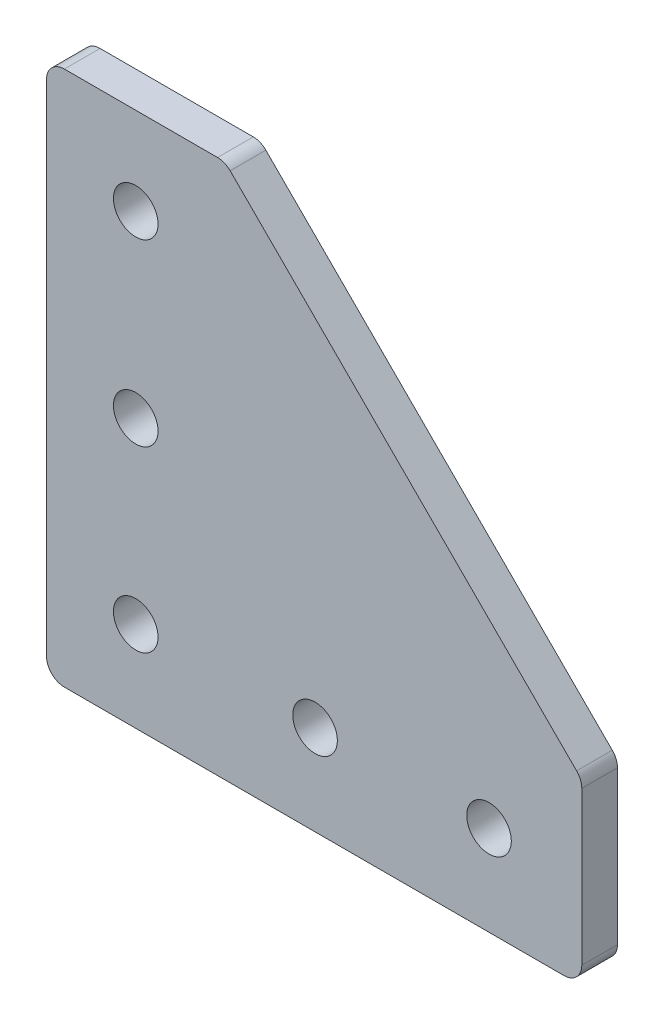
ISO-10303-21;
HEADER;
FILE_DESCRIPTION(('STEP AP214'),'2;1');
FILE_NAME('part.step','',(''),(''),'','','');
FILE_SCHEMA(('AUTOMOTIVE_DESIGN { 1 0 10303 214 1 1 1 1 }'));
ENDSEC;
DATA;
#1=APPLICATION_CONTEXT('core data for automotive mechanical design processes');
#2=APPLICATION_PROTOCOL_DEFINITION('international standard','automotive_design',2000,#1);
#3=PRODUCT_CONTEXT('',#1,'mechanical');
#4=PRODUCT('Part','Part','',(#3));
#5=PRODUCT_RELATED_PRODUCT_CATEGORY('part','',(#4));
#6=PRODUCT_DEFINITION_FORMATION('','',#4);
#7=PRODUCT_DEFINITION_CONTEXT('part definition',#1,'design');
#8=PRODUCT_DEFINITION('design','',#6,#7);
#9=PRODUCT_DEFINITION_SHAPE('','',#8);
#10=(LENGTH_UNIT() NAMED_UNIT(*) SI_UNIT(.MILLI.,.METRE.));
#11=(NAMED_UNIT(*) PLANE_ANGLE_UNIT() SI_UNIT($,.RADIAN.));
#12=(NAMED_UNIT(*) SI_UNIT($,.STERADIAN.) SOLID_ANGLE_UNIT());
#13=UNCERTAINTY_MEASURE_WITH_UNIT(LENGTH_MEASURE(1.E-05),#10,'distance_accuracy_value','');
#14=(GEOMETRIC_REPRESENTATION_CONTEXT(3) GLOBAL_UNCERTAINTY_ASSIGNED_CONTEXT((#13)) GLOBAL_UNIT_ASSIGNED_CONTEXT((#10,
#11,#12)) REPRESENTATION_CONTEXT('',''));
#15=CARTESIAN_POINT('',(0.,0.,0.));
#16=DIRECTION('',(0.,0.,1.));
#17=DIRECTION('',(1.,0.,0.));
#18=AXIS2_PLACEMENT_3D('',#15,#16,#17);
#19=CARTESIAN_POINT('',(-31.3742099073397,-27.0753737227938,0.450058925300255));
#20=DIRECTION('',(0.,1.,0.));
#21=DIRECTION('',(0.,0.,1.));
#22=AXIS2_PLACEMENT_3D('',#19,#20,#21);
#23=PLANE('',#22);
#24=DIRECTION('',(1.,0.,0.));
#25=VECTOR('',#24,1.);
#26=CARTESIAN_POINT('',(-31.3742099073397,-27.0753737227938,-3.54994107469975));
#27=LINE('',#26,#25);
#28=CARTESIAN_POINT('',(-29.3742099073397,-27.0753737227938,-3.54994107469975));
#29=VERTEX_POINT('',#28);
#30=CARTESIAN_POINT('',(26.6257900926603,-27.0753737227938,-3.54994107469975));
#31=VERTEX_POINT('',#30);
#32=EDGE_CURVE('E178',#29,#31,#27,.T.);
#33=ORIENTED_EDGE('',*,*,#32,.T.);
#34=DIRECTION('',(0.,0.,-1.));
#35=VECTOR('',#34,1.);
#36=CARTESIAN_POINT('',(26.6257900926603,-27.0753737227938,0.450058925300255));
#37=LINE('',#36,#35);
#38=CARTESIAN_POINT('',(26.6257900926603,-27.0753737227938,0.450058925300255));
#39=VERTEX_POINT('',#38);
#40=EDGE_CURVE('E149',#31,#39,#37,.F.);
#41=ORIENTED_EDGE('',*,*,#40,.T.);
#42=DIRECTION('',(1.,0.,0.));
#43=VECTOR('',#42,1.);
#44=CARTESIAN_POINT('',(-31.3742099073397,-27.0753737227938,0.450058925300255));
#45=LINE('',#44,#43);
#46=CARTESIAN_POINT('',(-29.3742099073397,-27.0753737227938,0.450058925300255));
#47=VERTEX_POINT('',#46);
#48=EDGE_CURVE('E123',#47,#39,#45,.T.);
#49=ORIENTED_EDGE('',*,*,#48,.F.);
#50=DIRECTION('',(0.,0.,-1.));
#51=VECTOR('',#50,1.);
#52=CARTESIAN_POINT('',(-29.3742099073397,-27.0753737227938,0.450058925300255));
#53=LINE('',#52,#51);
#54=EDGE_CURVE('E146',#47,#29,#53,.T.);
#55=ORIENTED_EDGE('',*,*,#54,.T.);
#56=EDGE_LOOP('',(#33,#41,#49,#55));
#57=FACE_BOUND('',#56,.T.);
#58=ADVANCED_FACE('F16',(#57),#23,.F.);
#59=CARTESIAN_POINT('',(28.6257900926603,-27.0753737227938,0.450058925300255));
#60=DIRECTION('',(-1.,0.,0.));
#61=DIRECTION('',(0.,0.,1.));
#62=AXIS2_PLACEMENT_3D('',#59,#60,#61);
#63=PLANE('',#62);
#64=DIRECTION('',(0.,1.,0.));
#65=VECTOR('',#64,1.);
#66=CARTESIAN_POINT('',(28.6257900926603,-27.0753737227938,-3.54994107469975));
#67=LINE('',#66,#65);
#68=CARTESIAN_POINT('',(28.6257900926603,-25.0753737227938,-3.54994107469975));
#69=VERTEX_POINT('',#68);
#70=CARTESIAN_POINT('',(28.6257900926603,-7.90380084753994,-3.54994107469975));
#71=VERTEX_POINT('',#70);
#72=EDGE_CURVE('E175',#69,#71,#67,.T.);
#73=ORIENTED_EDGE('',*,*,#72,.T.);
#74=DIRECTION('',(0.,0.,-1.));
#75=VECTOR('',#74,1.);
#76=CARTESIAN_POINT('',(28.6257900926603,-7.90380084753994,0.450058925300255));
#77=LINE('',#76,#75);
#78=CARTESIAN_POINT('',(28.6257900926603,-7.90380084753994,0.450058925300255));
#79=VERTEX_POINT('',#78);
#80=EDGE_CURVE('E39',#71,#79,#77,.F.);
#81=ORIENTED_EDGE('',*,*,#80,.T.);
#82=DIRECTION('',(0.,1.,0.));
#83=VECTOR('',#82,1.);
#84=CARTESIAN_POINT('',(28.6257900926603,-27.0753737227938,0.450058925300255));
#85=LINE('',#84,#83);
#86=CARTESIAN_POINT('',(28.6257900926603,-25.0753737227938,0.450058925300255));
#87=VERTEX_POINT('',#86);
#88=EDGE_CURVE('E127',#87,#79,#85,.T.);
#89=ORIENTED_EDGE('',*,*,#88,.F.);
#90=DIRECTION('',(0.,0.,-1.));
#91=VECTOR('',#90,1.);
#92=CARTESIAN_POINT('',(28.6257900926603,-25.0753737227938,0.450058925300255));
#93=LINE('',#92,#91);
#94=EDGE_CURVE('E143',#87,#69,#93,.T.);
#95=ORIENTED_EDGE('',*,*,#94,.T.);
#96=EDGE_LOOP('',(#73,#81,#89,#95));
#97=FACE_BOUND('',#96,.T.);
#98=ADVANCED_FACE('F176',(#97),#63,.F.);
#99=CARTESIAN_POINT('',(-11.3742099073397,32.9246262772062,0.450058925300255));
#100=DIRECTION('',(-0.707106781186547,-0.707106781186547,0.));
#101=DIRECTION('',(0.707106781186548,-0.707106781186548,0.));
#102=AXIS2_PLACEMENT_3D('',#99,#100,#101);
#103=PLANE('',#102);
#104=DIRECTION('',(-0.707106781186548,0.707106781186548,0.));
#105=VECTOR('',#104,1.);
#106=CARTESIAN_POINT('',(-11.3742099073397,32.9246262772062,0.450058925300255));
#107=LINE('',#106,#105);
#108=CARTESIAN_POINT('',(28.0400036550334,-6.48958728516685,0.450058925300255));
#109=VERTEX_POINT('',#108);
#110=CARTESIAN_POINT('',(-10.7884234697128,32.3388398395793,0.450058925300255));
#111=VERTEX_POINT('',#110);
#112=EDGE_CURVE('E164',#109,#111,#107,.T.);
#113=ORIENTED_EDGE('',*,*,#112,.F.);
#114=DIRECTION('',(0.,0.,-1.));
#115=VECTOR('',#114,1.);
#116=CARTESIAN_POINT('',(28.0400036550334,-6.48958728516685,0.450058925300255));
#117=LINE('',#116,#115);
#118=CARTESIAN_POINT('',(28.0400036550334,-6.48958728516685,-3.54994107469975));
#119=VERTEX_POINT('',#118);
#120=EDGE_CURVE('E153',#109,#119,#117,.T.);
#121=ORIENTED_EDGE('',*,*,#120,.T.);
#122=DIRECTION('',(-0.707106781186548,0.707106781186548,0.));
#123=VECTOR('',#122,1.);
#124=CARTESIAN_POINT('',(-11.3742099073397,32.9246262772062,-3.54994107469975));
#125=LINE('',#124,#123);
#126=CARTESIAN_POINT('',(-10.7884234697128,32.3388398395793,-3.54994107469975));
#127=VERTEX_POINT('',#126);
#128=EDGE_CURVE('E129',#119,#127,#125,.T.);
#129=ORIENTED_EDGE('',*,*,#128,.T.);
#130=DIRECTION('',(0.,0.,-1.));
#131=VECTOR('',#130,1.);
#132=CARTESIAN_POINT('',(-10.7884234697128,32.3388398395793,0.450058925300255));
#133=LINE('',#132,#131);
#134=EDGE_CURVE('E151',#127,#111,#133,.F.);
#135=ORIENTED_EDGE('',*,*,#134,.T.);
#136=EDGE_LOOP('',(#113,#121,#129,#135));
#137=FACE_BOUND('',#136,.T.);
#138=ADVANCED_FACE('F168',(#137),#103,.F.);
#139=CARTESIAN_POINT('',(-31.3742099073397,32.9246262772062,0.450058925300255));
#140=DIRECTION('',(0.,-1.,0.));
#141=DIRECTION('',(0.,0.,-1.));
#142=AXIS2_PLACEMENT_3D('',#139,#140,#141);
#143=PLANE('',#142);
#144=DIRECTION('',(-1.,0.,0.));
#145=VECTOR('',#144,1.);
#146=CARTESIAN_POINT('',(-31.3742099073397,32.9246262772062,0.450058925300255));
#147=LINE('',#146,#145);
#148=CARTESIAN_POINT('',(-12.2026370320859,32.9246262772062,0.450058925300255));
#149=VERTEX_POINT('',#148);
#150=CARTESIAN_POINT('',(-29.3742099073397,32.9246262772062,0.450058925300255));
#151=VERTEX_POINT('',#150);
#152=EDGE_CURVE('E171',#149,#151,#147,.T.);
#153=ORIENTED_EDGE('',*,*,#152,.F.);
#154=DIRECTION('',(0.,0.,-1.));
#155=VECTOR('',#154,1.);
#156=CARTESIAN_POINT('',(-12.2026370320859,32.9246262772062,0.450058925300255));
#157=LINE('',#156,#155);
#158=CARTESIAN_POINT('',(-12.2026370320859,32.9246262772062,-3.54994107469975));
#159=VERTEX_POINT('',#158);
#160=EDGE_CURVE('E10',#149,#159,#157,.T.);
#161=ORIENTED_EDGE('',*,*,#160,.T.);
#162=DIRECTION('',(-1.,0.,0.));
#163=VECTOR('',#162,1.);
#164=CARTESIAN_POINT('',(-31.3742099073397,32.9246262772062,-3.54994107469975));
#165=LINE('',#164,#163);
#166=CARTESIAN_POINT('',(-29.3742099073397,32.9246262772062,-3.54994107469975));
#167=VERTEX_POINT('',#166);
#168=EDGE_CURVE('E124',#159,#167,#165,.T.);
#169=ORIENTED_EDGE('',*,*,#168,.T.);
#170=DIRECTION('',(0.,0.,-1.));
#171=VECTOR('',#170,1.);
#172=CARTESIAN_POINT('',(-29.3742099073397,32.9246262772062,0.450058925300255));
#173=LINE('',#172,#171);
#174=EDGE_CURVE('E103',#167,#151,#173,.F.);
#175=ORIENTED_EDGE('',*,*,#174,.T.);
#176=EDGE_LOOP('',(#153,#161,#169,#175));
#177=FACE_BOUND('',#176,.T.);
#178=ADVANCED_FACE('F272',(#177),#143,.F.);
#179=CARTESIAN_POINT('',(-31.3742099073397,-27.0753737227938,0.450058925300255));
#180=DIRECTION('',(1.,0.,0.));
#181=DIRECTION('',(0.,0.,-1.));
#182=AXIS2_PLACEMENT_3D('',#179,#180,#181);
#183=PLANE('',#182);
#184=DIRECTION('',(0.,-1.,0.));
#185=VECTOR('',#184,1.);
#186=CARTESIAN_POINT('',(-31.3742099073397,-27.0753737227938,0.450058925300255));
#187=LINE('',#186,#185);
#188=CARTESIAN_POINT('',(-31.3742099073397,30.9246262772062,0.450058925300255));
#189=VERTEX_POINT('',#188);
#190=CARTESIAN_POINT('',(-31.3742099073397,-25.0753737227938,0.450058925300255));
#191=VERTEX_POINT('',#190);
#192=EDGE_CURVE('E116',#189,#191,#187,.T.);
#193=ORIENTED_EDGE('',*,*,#192,.F.);
#194=DIRECTION('',(0.,0.,-1.));
#195=VECTOR('',#194,1.);
#196=CARTESIAN_POINT('',(-31.3742099073397,30.9246262772062,0.450058925300255));
#197=LINE('',#196,#195);
#198=CARTESIAN_POINT('',(-31.3742099073397,30.9246262772062,-3.54994107469975));
#199=VERTEX_POINT('',#198);
#200=EDGE_CURVE('E101',#189,#199,#197,.T.);
#201=ORIENTED_EDGE('',*,*,#200,.T.);
#202=DIRECTION('',(0.,-1.,0.));
#203=VECTOR('',#202,1.);
#204=CARTESIAN_POINT('',(-31.3742099073397,-27.0753737227938,-3.54994107469975));
#205=LINE('',#204,#203);
#206=CARTESIAN_POINT('',(-31.3742099073397,-25.0753737227938,-3.54994107469975));
#207=VERTEX_POINT('',#206);
#208=EDGE_CURVE('E113',#199,#207,#205,.T.);
#209=ORIENTED_EDGE('',*,*,#208,.T.);
#210=DIRECTION('',(0.,0.,-1.));
#211=VECTOR('',#210,1.);
#212=CARTESIAN_POINT('',(-31.3742099073397,-25.0753737227938,0.450058925300255));
#213=LINE('',#212,#211);
#214=EDGE_CURVE('E118',#207,#191,#213,.F.);
#215=ORIENTED_EDGE('',*,*,#214,.T.);
#216=EDGE_LOOP('',(#193,#201,#209,#215));
#217=FACE_BOUND('',#216,.T.);
#218=ADVANCED_FACE('F112',(#217),#183,.F.);
#219=CARTESIAN_POINT('',(-31.3742099073397,-27.0753737227938,0.450058925300255));
#220=DIRECTION('',(0.,0.,1.));
#221=DIRECTION('',(1.,0.,0.));
#222=AXIS2_PLACEMENT_3D('',#219,#220,#221);
#223=PLANE('',#222);
#224=CARTESIAN_POINT('',(-21.3742099073397,23.1246262772062,0.450058925300255));
#225=DIRECTION('',(0.,0.,1.));
#226=DIRECTION('',(1.,0.,0.));
#227=AXIS2_PLACEMENT_3D('',#224,#225,#226);
#228=CIRCLE('',#227,2.5);
#229=CARTESIAN_POINT('',(-18.8742099073397,23.1246262772062,0.450058925300255));
#230=VERTEX_POINT('',#229);
#231=EDGE_CURVE('E193',#230,#230,#228,.T.);
#232=ORIENTED_EDGE('',*,*,#231,.F.);
#233=EDGE_LOOP('',(#232));
#234=FACE_BOUND('',#233,.T.);
#235=CARTESIAN_POINT('',(-21.3742099073397,3.02462627720625,0.450058925300255));
#236=DIRECTION('',(0.,0.,1.));
#237=DIRECTION('',(1.,0.,0.));
#238=AXIS2_PLACEMENT_3D('',#235,#236,#237);
#239=CIRCLE('',#238,2.5);
#240=CARTESIAN_POINT('',(-18.8742099073397,3.02462627720625,0.450058925300255));
#241=VERTEX_POINT('',#240);
#242=EDGE_CURVE('E199',#241,#241,#239,.T.);
#243=ORIENTED_EDGE('',*,*,#242,.F.);
#244=EDGE_LOOP('',(#243));
#245=FACE_BOUND('',#244,.T.);
#246=CARTESIAN_POINT('',(18.2257900926603,-16.9753737227938,0.450058925300255));
#247=DIRECTION('',(0.,0.,1.));
#248=DIRECTION('',(1.,0.,0.));
#249=AXIS2_PLACEMENT_3D('',#246,#247,#248);
#250=CIRCLE('',#249,2.5);
#251=CARTESIAN_POINT('',(20.7257900926603,-16.9753737227938,0.450058925300255));
#252=VERTEX_POINT('',#251);
#253=EDGE_CURVE('E205',#252,#252,#250,.T.);
#254=ORIENTED_EDGE('',*,*,#253,.F.);
#255=EDGE_LOOP('',(#254));
#256=FACE_BOUND('',#255,.T.);
#257=CARTESIAN_POINT('',(-1.27420990733971,-16.9753737227938,0.450058925300255));
#258=DIRECTION('',(0.,0.,1.));
#259=DIRECTION('',(1.,0.,0.));
#260=AXIS2_PLACEMENT_3D('',#257,#258,#259);
#261=CIRCLE('',#260,2.5);
#262=CARTESIAN_POINT('',(1.22579009266029,-16.9753737227938,0.450058925300255));
#263=VERTEX_POINT('',#262);
#264=EDGE_CURVE('E211',#263,#263,#261,.T.);
#265=ORIENTED_EDGE('',*,*,#264,.F.);
#266=EDGE_LOOP('',(#265));
#267=FACE_BOUND('',#266,.T.);
#268=CARTESIAN_POINT('',(-21.3742099073397,-16.9753737227938,0.450058925300255));
#269=DIRECTION('',(0.,0.,1.));
#270=DIRECTION('',(1.,0.,0.));
#271=AXIS2_PLACEMENT_3D('',#268,#269,#270);
#272=CIRCLE('',#271,2.5);
#273=CARTESIAN_POINT('',(-18.8742099073397,-16.9753737227938,0.450058925300255));
#274=VERTEX_POINT('',#273);
#275=EDGE_CURVE('E187',#274,#274,#272,.T.);
#276=ORIENTED_EDGE('',*,*,#275,.F.);
#277=EDGE_LOOP('',(#276));
#278=FACE_BOUND('',#277,.T.);
#279=ORIENTED_EDGE('',*,*,#88,.T.);
#280=CARTESIAN_POINT('',(26.6257900926603,-7.90380084753994,0.450058925300255));
#281=DIRECTION('',(0.,0.,1.));
#282=DIRECTION('',(1.,0.,0.));
#283=AXIS2_PLACEMENT_3D('',#280,#281,#282);
#284=CIRCLE('',#283,2.);
#285=EDGE_CURVE('E24',#79,#109,#284,.T.);
#286=ORIENTED_EDGE('',*,*,#285,.T.);
#287=ORIENTED_EDGE('',*,*,#112,.T.);
#288=CARTESIAN_POINT('',(-12.2026370320859,30.9246262772062,0.450058925300255));
#289=DIRECTION('',(0.,0.,1.));
#290=DIRECTION('',(1.,0.,0.));
#291=AXIS2_PLACEMENT_3D('',#288,#289,#290);
#292=CIRCLE('',#291,2.);
#293=EDGE_CURVE('E31',#111,#149,#292,.T.);
#294=ORIENTED_EDGE('',*,*,#293,.T.);
#295=ORIENTED_EDGE('',*,*,#152,.T.);
#296=CARTESIAN_POINT('',(-29.3742099073397,30.9246262772062,0.450058925300255));
#297=DIRECTION('',(0.,0.,1.));
#298=DIRECTION('',(1.,0.,0.));
#299=AXIS2_PLACEMENT_3D('',#296,#297,#298);
#300=CIRCLE('',#299,2.);
#301=EDGE_CURVE('E141',#151,#189,#300,.T.);
#302=ORIENTED_EDGE('',*,*,#301,.T.);
#303=ORIENTED_EDGE('',*,*,#192,.T.);
#304=CARTESIAN_POINT('',(-29.3742099073397,-25.0753737227938,0.450058925300255));
#305=DIRECTION('',(0.,0.,1.));
#306=DIRECTION('',(1.,0.,0.));
#307=AXIS2_PLACEMENT_3D('',#304,#305,#306);
#308=CIRCLE('',#307,2.);
#309=EDGE_CURVE('E137',#191,#47,#308,.T.);
#310=ORIENTED_EDGE('',*,*,#309,.T.);
#311=ORIENTED_EDGE('',*,*,#48,.T.);
#312=CARTESIAN_POINT('',(26.6257900926603,-25.0753737227938,0.450058925300255));
#313=DIRECTION('',(0.,0.,1.));
#314=DIRECTION('',(1.,0.,0.));
#315=AXIS2_PLACEMENT_3D('',#312,#313,#314);
#316=CIRCLE('',#315,2.);
#317=EDGE_CURVE('E139',#39,#87,#316,.T.);
#318=ORIENTED_EDGE('',*,*,#317,.T.);
#319=EDGE_LOOP('',(#279,#286,#287,#294,#295,#302,#303,#310,#311,#318));
#320=FACE_BOUND('',#319,.T.);
#321=ADVANCED_FACE('F163',(#234,#245,#256,#267,#278,#320),#223,.T.);
#322=CARTESIAN_POINT('',(-31.3742099073397,-27.0753737227938,-3.54994107469975));
#323=DIRECTION('',(0.,0.,1.));
#324=DIRECTION('',(1.,0.,0.));
#325=AXIS2_PLACEMENT_3D('',#322,#323,#324);
#326=PLANE('',#325);
#327=CARTESIAN_POINT('',(-21.3742099073397,23.1246262772062,-3.54994107469975));
#328=DIRECTION('',(0.,0.,1.));
#329=DIRECTION('',(1.,0.,0.));
#330=AXIS2_PLACEMENT_3D('',#327,#328,#329);
#331=CIRCLE('',#330,2.5);
#332=CARTESIAN_POINT('',(-18.8742099073397,23.1246262772062,-3.54994107469975));
#333=VERTEX_POINT('',#332);
#334=EDGE_CURVE('E196',#333,#333,#331,.T.);
#335=ORIENTED_EDGE('',*,*,#334,.T.);
#336=EDGE_LOOP('',(#335));
#337=FACE_BOUND('',#336,.T.);
#338=CARTESIAN_POINT('',(-21.3742099073397,3.02462627720625,-3.54994107469975));
#339=DIRECTION('',(0.,0.,1.));
#340=DIRECTION('',(1.,0.,0.));
#341=AXIS2_PLACEMENT_3D('',#338,#339,#340);
#342=CIRCLE('',#341,2.5);
#343=CARTESIAN_POINT('',(-18.8742099073397,3.02462627720625,-3.54994107469975));
#344=VERTEX_POINT('',#343);
#345=EDGE_CURVE('E202',#344,#344,#342,.T.);
#346=ORIENTED_EDGE('',*,*,#345,.T.);
#347=EDGE_LOOP('',(#346));
#348=FACE_BOUND('',#347,.T.);
#349=CARTESIAN_POINT('',(18.2257900926603,-16.9753737227938,-3.54994107469975));
#350=DIRECTION('',(0.,0.,1.));
#351=DIRECTION('',(1.,0.,0.));
#352=AXIS2_PLACEMENT_3D('',#349,#350,#351);
#353=CIRCLE('',#352,2.5);
#354=CARTESIAN_POINT('',(20.7257900926603,-16.9753737227938,-3.54994107469975));
#355=VERTEX_POINT('',#354);
#356=EDGE_CURVE('E208',#355,#355,#353,.T.);
#357=ORIENTED_EDGE('',*,*,#356,.T.);
#358=EDGE_LOOP('',(#357));
#359=FACE_BOUND('',#358,.T.);
#360=CARTESIAN_POINT('',(-1.27420990733971,-16.9753737227938,-3.54994107469975));
#361=DIRECTION('',(0.,0.,1.));
#362=DIRECTION('',(1.,0.,0.));
#363=AXIS2_PLACEMENT_3D('',#360,#361,#362);
#364=CIRCLE('',#363,2.5);
#365=CARTESIAN_POINT('',(1.22579009266029,-16.9753737227938,-3.54994107469975));
#366=VERTEX_POINT('',#365);
#367=EDGE_CURVE('E190',#366,#366,#364,.T.);
#368=ORIENTED_EDGE('',*,*,#367,.T.);
#369=EDGE_LOOP('',(#368));
#370=FACE_BOUND('',#369,.T.);
#371=CARTESIAN_POINT('',(-21.3742099073397,-16.9753737227938,-3.54994107469975));
#372=DIRECTION('',(0.,0.,1.));
#373=DIRECTION('',(1.,0.,0.));
#374=AXIS2_PLACEMENT_3D('',#371,#372,#373);
#375=CIRCLE('',#374,2.5);
#376=CARTESIAN_POINT('',(-18.8742099073397,-16.9753737227938,-3.54994107469975));
#377=VERTEX_POINT('',#376);
#378=EDGE_CURVE('E181',#377,#377,#375,.T.);
#379=ORIENTED_EDGE('',*,*,#378,.T.);
#380=EDGE_LOOP('',(#379));
#381=FACE_BOUND('',#380,.T.);
#382=ORIENTED_EDGE('',*,*,#128,.F.);
#383=CARTESIAN_POINT('',(26.6257900926603,-7.90380084753994,-3.54994107469975));
#384=DIRECTION('',(0.,0.,1.));
#385=DIRECTION('',(1.,0.,0.));
#386=AXIS2_PLACEMENT_3D('',#383,#384,#385);
#387=CIRCLE('',#386,2.);
#388=EDGE_CURVE('E158',#119,#71,#387,.F.);
#389=ORIENTED_EDGE('',*,*,#388,.T.);
#390=ORIENTED_EDGE('',*,*,#72,.F.);
#391=CARTESIAN_POINT('',(26.6257900926603,-25.0753737227938,-3.54994107469975));
#392=DIRECTION('',(0.,0.,1.));
#393=DIRECTION('',(1.,0.,0.));
#394=AXIS2_PLACEMENT_3D('',#391,#392,#393);
#395=CIRCLE('',#394,2.);
#396=EDGE_CURVE('E107',#69,#31,#395,.F.);
#397=ORIENTED_EDGE('',*,*,#396,.T.);
#398=ORIENTED_EDGE('',*,*,#32,.F.);
#399=CARTESIAN_POINT('',(-29.3742099073397,-25.0753737227938,-3.54994107469975));
#400=DIRECTION('',(0.,0.,1.));
#401=DIRECTION('',(1.,0.,0.));
#402=AXIS2_PLACEMENT_3D('',#399,#400,#401);
#403=CIRCLE('',#402,2.);
#404=EDGE_CURVE('E117',#29,#207,#403,.F.);
#405=ORIENTED_EDGE('',*,*,#404,.T.);
#406=ORIENTED_EDGE('',*,*,#208,.F.);
#407=CARTESIAN_POINT('',(-29.3742099073397,30.9246262772062,-3.54994107469975));
#408=DIRECTION('',(0.,0.,1.));
#409=DIRECTION('',(1.,0.,0.));
#410=AXIS2_PLACEMENT_3D('',#407,#408,#409);
#411=CIRCLE('',#410,2.);
#412=EDGE_CURVE('E97',#199,#167,#411,.F.);
#413=ORIENTED_EDGE('',*,*,#412,.T.);
#414=ORIENTED_EDGE('',*,*,#168,.F.);
#415=CARTESIAN_POINT('',(-12.2026370320859,30.9246262772062,-3.54994107469975));
#416=DIRECTION('',(0.,0.,1.));
#417=DIRECTION('',(1.,0.,0.));
#418=AXIS2_PLACEMENT_3D('',#415,#416,#417);
#419=CIRCLE('',#418,2.);
#420=EDGE_CURVE('E156',#159,#127,#419,.F.);
#421=ORIENTED_EDGE('',*,*,#420,.T.);
#422=EDGE_LOOP('',(#382,#389,#390,#397,#398,#405,#406,#413,#414,#421));
#423=FACE_BOUND('',#422,.T.);
#424=ADVANCED_FACE('F121',(#337,#348,#359,#370,#381,#423),#326,.F.);
#425=CARTESIAN_POINT('',(-21.3742099073397,-16.9753737227938,-3.54994107469975));
#426=DIRECTION('',(0.,0.,1.));
#427=DIRECTION('',(1.,0.,0.));
#428=AXIS2_PLACEMENT_3D('',#425,#426,#427);
#429=CYLINDRICAL_SURFACE('',#428,2.5);
#430=ORIENTED_EDGE('',*,*,#378,.F.);
#431=EDGE_LOOP('',(#430));
#432=FACE_BOUND('',#431,.T.);
#433=ORIENTED_EDGE('',*,*,#275,.T.);
#434=EDGE_LOOP('',(#433));
#435=FACE_BOUND('',#434,.T.);
#436=ADVANCED_FACE('F223',(#432,#435),#429,.F.);
#437=CARTESIAN_POINT('',(-1.27420990733971,-16.9753737227938,-3.54994107469975));
#438=DIRECTION('',(0.,0.,1.));
#439=DIRECTION('',(1.,0.,0.));
#440=AXIS2_PLACEMENT_3D('',#437,#438,#439);
#441=CYLINDRICAL_SURFACE('',#440,2.5);
#442=ORIENTED_EDGE('',*,*,#367,.F.);
#443=EDGE_LOOP('',(#442));
#444=FACE_BOUND('',#443,.T.);
#445=ORIENTED_EDGE('',*,*,#264,.T.);
#446=EDGE_LOOP('',(#445));
#447=FACE_BOUND('',#446,.T.);
#448=ADVANCED_FACE('F219',(#444,#447),#441,.F.);
#449=CARTESIAN_POINT('',(18.2257900926603,-16.9753737227938,-3.54994107469975));
#450=DIRECTION('',(0.,0.,1.));
#451=DIRECTION('',(1.,0.,0.));
#452=AXIS2_PLACEMENT_3D('',#449,#450,#451);
#453=CYLINDRICAL_SURFACE('',#452,2.5);
#454=ORIENTED_EDGE('',*,*,#356,.F.);
#455=EDGE_LOOP('',(#454));
#456=FACE_BOUND('',#455,.T.);
#457=ORIENTED_EDGE('',*,*,#253,.T.);
#458=EDGE_LOOP('',(#457));
#459=FACE_BOUND('',#458,.T.);
#460=ADVANCED_FACE('F222',(#456,#459),#453,.F.);
#461=CARTESIAN_POINT('',(-21.3742099073397,3.02462627720625,-3.54994107469975));
#462=DIRECTION('',(0.,0.,1.));
#463=DIRECTION('',(1.,0.,0.));
#464=AXIS2_PLACEMENT_3D('',#461,#462,#463);
#465=CYLINDRICAL_SURFACE('',#464,2.5);
#466=ORIENTED_EDGE('',*,*,#345,.F.);
#467=EDGE_LOOP('',(#466));
#468=FACE_BOUND('',#467,.T.);
#469=ORIENTED_EDGE('',*,*,#242,.T.);
#470=EDGE_LOOP('',(#469));
#471=FACE_BOUND('',#470,.T.);
#472=ADVANCED_FACE('F342',(#468,#471),#465,.F.);
#473=CARTESIAN_POINT('',(-21.3742099073397,23.1246262772062,-3.54994107469975));
#474=DIRECTION('',(0.,0.,1.));
#475=DIRECTION('',(1.,0.,0.));
#476=AXIS2_PLACEMENT_3D('',#473,#474,#475);
#477=CYLINDRICAL_SURFACE('',#476,2.5);
#478=ORIENTED_EDGE('',*,*,#334,.F.);
#479=EDGE_LOOP('',(#478));
#480=FACE_BOUND('',#479,.T.);
#481=ORIENTED_EDGE('',*,*,#231,.T.);
#482=EDGE_LOOP('',(#481));
#483=FACE_BOUND('',#482,.T.);
#484=ADVANCED_FACE('F256',(#480,#483),#477,.F.);
#485=CARTESIAN_POINT('',(-29.3742099073397,30.9246262772062,0.450058925300255));
#486=DIRECTION('',(0.,0.,-1.));
#487=DIRECTION('',(-1.,0.,0.));
#488=AXIS2_PLACEMENT_3D('',#485,#486,#487);
#489=CYLINDRICAL_SURFACE('',#488,2.);
#490=ORIENTED_EDGE('',*,*,#301,.F.);
#491=ORIENTED_EDGE('',*,*,#174,.F.);
#492=ORIENTED_EDGE('',*,*,#412,.F.);
#493=ORIENTED_EDGE('',*,*,#200,.F.);
#494=EDGE_LOOP('',(#490,#491,#492,#493));
#495=FACE_BOUND('',#494,.T.);
#496=ADVANCED_FACE('F100',(#495),#489,.T.);
#497=CARTESIAN_POINT('',(26.6257900926603,-25.0753737227938,0.450058925300255));
#498=DIRECTION('',(0.,0.,-1.));
#499=DIRECTION('',(-1.,0.,0.));
#500=AXIS2_PLACEMENT_3D('',#497,#498,#499);
#501=CYLINDRICAL_SURFACE('',#500,2.);
#502=ORIENTED_EDGE('',*,*,#317,.F.);
#503=ORIENTED_EDGE('',*,*,#40,.F.);
#504=ORIENTED_EDGE('',*,*,#396,.F.);
#505=ORIENTED_EDGE('',*,*,#94,.F.);
#506=EDGE_LOOP('',(#502,#503,#504,#505));
#507=FACE_BOUND('',#506,.T.);
#508=ADVANCED_FACE('F255',(#507),#501,.T.);
#509=CARTESIAN_POINT('',(-29.3742099073397,-25.0753737227938,0.450058925300255));
#510=DIRECTION('',(0.,0.,-1.));
#511=DIRECTION('',(-1.,0.,0.));
#512=AXIS2_PLACEMENT_3D('',#509,#510,#511);
#513=CYLINDRICAL_SURFACE('',#512,2.);
#514=ORIENTED_EDGE('',*,*,#309,.F.);
#515=ORIENTED_EDGE('',*,*,#214,.F.);
#516=ORIENTED_EDGE('',*,*,#404,.F.);
#517=ORIENTED_EDGE('',*,*,#54,.F.);
#518=EDGE_LOOP('',(#514,#515,#516,#517));
#519=FACE_BOUND('',#518,.T.);
#520=ADVANCED_FACE('F259',(#519),#513,.T.);
#521=CARTESIAN_POINT('',(26.6257900926603,-7.90380084753994,0.450058925300255));
#522=DIRECTION('',(0.,0.,-1.));
#523=DIRECTION('',(-1.,0.,0.));
#524=AXIS2_PLACEMENT_3D('',#521,#522,#523);
#525=CYLINDRICAL_SURFACE('',#524,2.);
#526=ORIENTED_EDGE('',*,*,#285,.F.);
#527=ORIENTED_EDGE('',*,*,#80,.F.);
#528=ORIENTED_EDGE('',*,*,#388,.F.);
#529=ORIENTED_EDGE('',*,*,#120,.F.);
#530=EDGE_LOOP('',(#526,#527,#528,#529));
#531=FACE_BOUND('',#530,.T.);
#532=ADVANCED_FACE('F173',(#531),#525,.T.);
#533=CARTESIAN_POINT('',(-12.2026370320859,30.9246262772062,0.450058925300255));
#534=DIRECTION('',(0.,0.,-1.));
#535=DIRECTION('',(-1.,0.,0.));
#536=AXIS2_PLACEMENT_3D('',#533,#534,#535);
#537=CYLINDRICAL_SURFACE('',#536,2.);
#538=ORIENTED_EDGE('',*,*,#293,.F.);
#539=ORIENTED_EDGE('',*,*,#134,.F.);
#540=ORIENTED_EDGE('',*,*,#420,.F.);
#541=ORIENTED_EDGE('',*,*,#160,.F.);
#542=EDGE_LOOP('',(#538,#539,#540,#541));
#543=FACE_BOUND('',#542,.T.);
#544=ADVANCED_FACE('F18',(#543),#537,.T.);
#545=CLOSED_SHELL('',(#58,#98,#138,#178,#218,#321,#424,#436,#448,#460,#472,#484,#496,#508,#520,
#532,#544));
#546=MANIFOLD_SOLID_BREP('B1',#545);
#547=ADVANCED_BREP_SHAPE_REPRESENTATION('',(#18,#546),#14);
#548=SHAPE_DEFINITION_REPRESENTATION(#9,#547);
ENDSEC;
END-ISO-10303-21;
